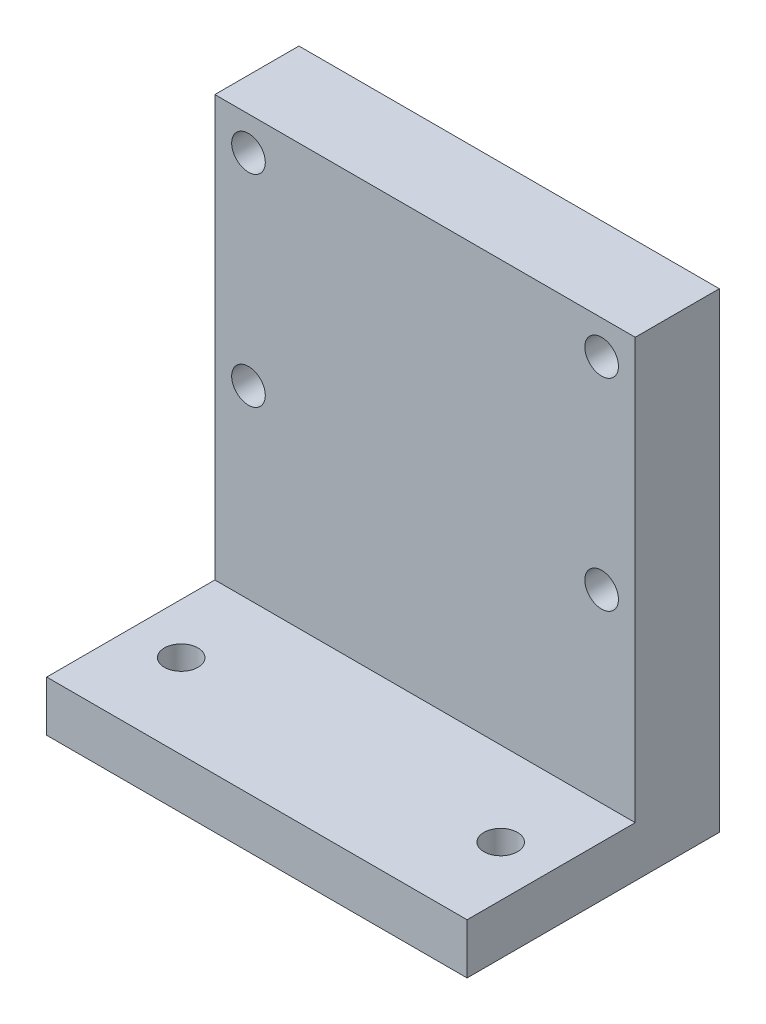
ISO-10303-21;
HEADER;
FILE_DESCRIPTION(('STEP AP214'),'2;1');
FILE_NAME('part.step','',(''),(''),'','','');
FILE_SCHEMA(('AUTOMOTIVE_DESIGN { 1 0 10303 214 1 1 1 1 }'));
ENDSEC;
DATA;
#1=APPLICATION_CONTEXT('core data for automotive mechanical design processes');
#2=APPLICATION_PROTOCOL_DEFINITION('international standard','automotive_design',2000,#1);
#3=PRODUCT_CONTEXT('',#1,'mechanical');
#4=PRODUCT('Part','Part','',(#3));
#5=PRODUCT_RELATED_PRODUCT_CATEGORY('part','',(#4));
#6=PRODUCT_DEFINITION_FORMATION('','',#4);
#7=PRODUCT_DEFINITION_CONTEXT('part definition',#1,'design');
#8=PRODUCT_DEFINITION('design','',#6,#7);
#9=PRODUCT_DEFINITION_SHAPE('','',#8);
#10=(LENGTH_UNIT() NAMED_UNIT(*) SI_UNIT(.MILLI.,.METRE.));
#11=(NAMED_UNIT(*) PLANE_ANGLE_UNIT() SI_UNIT($,.RADIAN.));
#12=(NAMED_UNIT(*) SI_UNIT($,.STERADIAN.) SOLID_ANGLE_UNIT());
#13=UNCERTAINTY_MEASURE_WITH_UNIT(LENGTH_MEASURE(1.E-05),#10,'distance_accuracy_value','');
#14=(GEOMETRIC_REPRESENTATION_CONTEXT(3) GLOBAL_UNCERTAINTY_ASSIGNED_CONTEXT((#13)) GLOBAL_UNIT_ASSIGNED_CONTEXT((#10,
#11,#12)) REPRESENTATION_CONTEXT('',''));
#15=CARTESIAN_POINT('',(0.,0.,0.));
#16=DIRECTION('',(0.,0.,1.));
#17=DIRECTION('',(1.,0.,0.));
#18=AXIS2_PLACEMENT_3D('',#15,#16,#17);
#19=CARTESIAN_POINT('',(7.12290502793296,17.5977653631285,35.));
#20=DIRECTION('',(-1.,0.,0.));
#21=DIRECTION('',(0.,-1.,0.));
#22=AXIS2_PLACEMENT_3D('',#19,#20,#21);
#23=PLANE('',#22);
#24=DIRECTION('',(0.,0.,1.));
#25=VECTOR('',#24,1.);
#26=CARTESIAN_POINT('',(7.12290502793297,-10.4022346368715,20.));
#27=LINE('',#26,#25);
#28=CARTESIAN_POINT('',(7.12290502793297,-10.4022346368715,5.));
#29=VERTEX_POINT('',#28);
#30=CARTESIAN_POINT('',(7.12290502793297,-10.4022346368715,20.));
#31=VERTEX_POINT('',#30);
#32=EDGE_CURVE('E63',#29,#31,#27,.T.);
#33=ORIENTED_EDGE('',*,*,#32,.F.);
#34=DIRECTION('',(0.,-1.,0.));
#35=VECTOR('',#34,1.);
#36=CARTESIAN_POINT('',(7.12290502793297,-10.4022346368715,5.));
#37=LINE('',#36,#35);
#38=CARTESIAN_POINT('',(7.12290502793297,17.5977653631285,5.));
#39=VERTEX_POINT('',#38);
#40=EDGE_CURVE('E56',#39,#29,#37,.T.);
#41=ORIENTED_EDGE('',*,*,#40,.F.);
#42=DIRECTION('',(0.,0.,-1.));
#43=VECTOR('',#42,1.);
#44=CARTESIAN_POINT('',(7.12290502793296,17.5977653631285,35.));
#45=LINE('',#44,#43);
#46=CARTESIAN_POINT('',(7.12290502793297,17.5977653631285,10.));
#47=VERTEX_POINT('',#46);
#48=EDGE_CURVE('E11',#47,#39,#45,.T.);
#49=ORIENTED_EDGE('',*,*,#48,.F.);
#50=DIRECTION('',(0.,1.,0.));
#51=VECTOR('',#50,1.);
#52=CARTESIAN_POINT('',(7.12290502793297,17.5977653631285,10.));
#53=LINE('',#52,#51);
#54=CARTESIAN_POINT('',(7.12290502793297,-7.40223463687151,10.));
#55=VERTEX_POINT('',#54);
#56=EDGE_CURVE('E158',#55,#47,#53,.T.);
#57=ORIENTED_EDGE('',*,*,#56,.F.);
#58=DIRECTION('',(0.,0.,1.));
#59=VECTOR('',#58,1.);
#60=CARTESIAN_POINT('',(7.12290502793297,-7.40223463687151,10.));
#61=LINE('',#60,#59);
#62=CARTESIAN_POINT('',(7.12290502793297,-7.40223463687151,20.));
#63=VERTEX_POINT('',#62);
#64=EDGE_CURVE('E165',#55,#63,#61,.T.);
#65=ORIENTED_EDGE('',*,*,#64,.T.);
#66=DIRECTION('',(0.,1.,0.));
#67=VECTOR('',#66,1.);
#68=CARTESIAN_POINT('',(7.12290502793297,-7.40223463687151,20.));
#69=LINE('',#68,#67);
#70=EDGE_CURVE('E144',#31,#63,#69,.T.);
#71=ORIENTED_EDGE('',*,*,#70,.F.);
#72=EDGE_LOOP('',(#33,#41,#49,#57,#65,#71));
#73=FACE_BOUND('',#72,.T.);
#74=ADVANCED_FACE('F39',(#73),#23,.F.);
#75=CARTESIAN_POINT('',(-17.877094972067,17.5977653631285,35.));
#76=DIRECTION('',(1.,0.,0.));
#77=DIRECTION('',(0.,1.,0.));
#78=AXIS2_PLACEMENT_3D('',#75,#76,#77);
#79=PLANE('',#78);
#80=DIRECTION('',(0.,0.,-1.));
#81=VECTOR('',#80,1.);
#82=CARTESIAN_POINT('',(-17.877094972067,17.5977653631285,35.));
#83=LINE('',#82,#81);
#84=CARTESIAN_POINT('',(-17.877094972067,17.5977653631285,10.));
#85=VERTEX_POINT('',#84);
#86=CARTESIAN_POINT('',(-17.877094972067,17.5977653631285,5.));
#87=VERTEX_POINT('',#86);
#88=EDGE_CURVE('E48',#85,#87,#83,.T.);
#89=ORIENTED_EDGE('',*,*,#88,.T.);
#90=DIRECTION('',(0.,1.,0.));
#91=VECTOR('',#90,1.);
#92=CARTESIAN_POINT('',(-17.877094972067,-10.4022346368715,5.));
#93=LINE('',#92,#91);
#94=CARTESIAN_POINT('',(-17.877094972067,-10.4022346368715,5.));
#95=VERTEX_POINT('',#94);
#96=EDGE_CURVE('E95',#95,#87,#93,.T.);
#97=ORIENTED_EDGE('',*,*,#96,.F.);
#98=DIRECTION('',(0.,0.,-1.));
#99=VECTOR('',#98,1.);
#100=CARTESIAN_POINT('',(-17.877094972067,-10.4022346368715,20.));
#101=LINE('',#100,#99);
#102=CARTESIAN_POINT('',(-17.877094972067,-10.4022346368715,20.));
#103=VERTEX_POINT('',#102);
#104=EDGE_CURVE('E105',#103,#95,#101,.T.);
#105=ORIENTED_EDGE('',*,*,#104,.F.);
#106=DIRECTION('',(0.,-1.,0.));
#107=VECTOR('',#106,1.);
#108=CARTESIAN_POINT('',(-17.877094972067,-7.40223463687151,20.));
#109=LINE('',#108,#107);
#110=CARTESIAN_POINT('',(-17.877094972067,-7.40223463687151,20.));
#111=VERTEX_POINT('',#110);
#112=EDGE_CURVE('E138',#111,#103,#109,.T.);
#113=ORIENTED_EDGE('',*,*,#112,.F.);
#114=DIRECTION('',(0.,0.,1.));
#115=VECTOR('',#114,1.);
#116=CARTESIAN_POINT('',(-17.877094972067,-7.40223463687151,10.));
#117=LINE('',#116,#115);
#118=CARTESIAN_POINT('',(-17.877094972067,-7.40223463687151,10.));
#119=VERTEX_POINT('',#118);
#120=EDGE_CURVE('E164',#119,#111,#117,.T.);
#121=ORIENTED_EDGE('',*,*,#120,.F.);
#122=DIRECTION('',(0.,-1.,0.));
#123=VECTOR('',#122,1.);
#124=CARTESIAN_POINT('',(-17.877094972067,17.5977653631285,10.));
#125=LINE('',#124,#123);
#126=EDGE_CURVE('E150',#85,#119,#125,.T.);
#127=ORIENTED_EDGE('',*,*,#126,.F.);
#128=EDGE_LOOP('',(#89,#97,#105,#113,#121,#127));
#129=FACE_BOUND('',#128,.T.);
#130=ADVANCED_FACE('F103',(#129),#79,.F.);
#131=CARTESIAN_POINT('',(0.,0.,20.));
#132=DIRECTION('',(0.,0.,1.));
#133=DIRECTION('',(1.,0.,0.));
#134=AXIS2_PLACEMENT_3D('',#131,#132,#133);
#135=PLANE('',#134);
#136=ORIENTED_EDGE('',*,*,#112,.T.);
#137=DIRECTION('',(-1.,0.,0.));
#138=VECTOR('',#137,1.);
#139=CARTESIAN_POINT('',(-17.877094972067,-10.4022346368715,20.));
#140=LINE('',#139,#138);
#141=EDGE_CURVE('E114',#31,#103,#140,.T.);
#142=ORIENTED_EDGE('',*,*,#141,.F.);
#143=ORIENTED_EDGE('',*,*,#70,.T.);
#144=DIRECTION('',(-1.,0.,0.));
#145=VECTOR('',#144,1.);
#146=CARTESIAN_POINT('',(-17.877094972067,-7.40223463687151,20.));
#147=LINE('',#146,#145);
#148=EDGE_CURVE('E147',#63,#111,#147,.T.);
#149=ORIENTED_EDGE('',*,*,#148,.T.);
#150=EDGE_LOOP('',(#136,#142,#143,#149));
#151=FACE_BOUND('',#150,.T.);
#152=ADVANCED_FACE('F191',(#151),#135,.T.);
#153=CARTESIAN_POINT('',(4.12290502793297,-22.4022346368715,15.));
#154=DIRECTION('',(0.,1.,0.));
#155=DIRECTION('',(0.,0.,1.));
#156=AXIS2_PLACEMENT_3D('',#153,#154,#155);
#157=CYLINDRICAL_SURFACE('',#156,1.);
#158=CARTESIAN_POINT('',(4.12290502793297,-7.40223463687151,15.));
#159=DIRECTION('',(0.,1.,0.));
#160=DIRECTION('',(0.,0.,1.));
#161=AXIS2_PLACEMENT_3D('',#158,#159,#160);
#162=CIRCLE('',#161,1.);
#163=CARTESIAN_POINT('',(4.12290502793297,-7.40223463687151,16.));
#164=VERTEX_POINT('',#163);
#165=EDGE_CURVE('E133',#164,#164,#162,.T.);
#166=ORIENTED_EDGE('',*,*,#165,.T.);
#167=EDGE_LOOP('',(#166));
#168=FACE_BOUND('',#167,.T.);
#169=CARTESIAN_POINT('',(4.12290502793297,-10.4022346368715,15.));
#170=DIRECTION('',(0.,-1.,0.));
#171=DIRECTION('',(1.,0.,0.));
#172=AXIS2_PLACEMENT_3D('',#169,#170,#171);
#173=CIRCLE('',#172,1.);
#174=CARTESIAN_POINT('',(5.12290502793297,-10.4022346368715,15.));
#175=VERTEX_POINT('',#174);
#176=EDGE_CURVE('E129',#175,#175,#173,.F.);
#177=ORIENTED_EDGE('',*,*,#176,.F.);
#178=EDGE_LOOP('',(#177));
#179=FACE_BOUND('',#178,.T.);
#180=ADVANCED_FACE('F181',(#168,#179),#157,.F.);
#181=CARTESIAN_POINT('',(-14.8779246782045,-22.4022346368715,15.));
#182=DIRECTION('',(0.,1.,0.));
#183=DIRECTION('',(0.,0.,1.));
#184=AXIS2_PLACEMENT_3D('',#181,#182,#183);
#185=CYLINDRICAL_SURFACE('',#184,1.);
#186=CARTESIAN_POINT('',(-14.8779246782045,-7.40223463687151,15.));
#187=DIRECTION('',(0.,1.,0.));
#188=DIRECTION('',(0.,0.,1.));
#189=AXIS2_PLACEMENT_3D('',#186,#187,#188);
#190=CIRCLE('',#189,1.);
#191=CARTESIAN_POINT('',(-14.8779246782045,-7.40223463687151,16.));
#192=VERTEX_POINT('',#191);
#193=EDGE_CURVE('E134',#192,#192,#190,.T.);
#194=ORIENTED_EDGE('',*,*,#193,.T.);
#195=EDGE_LOOP('',(#194));
#196=FACE_BOUND('',#195,.T.);
#197=CARTESIAN_POINT('',(-14.8779246782045,-10.4022346368715,15.));
#198=DIRECTION('',(0.,-1.,0.));
#199=DIRECTION('',(1.,0.,0.));
#200=AXIS2_PLACEMENT_3D('',#197,#198,#199);
#201=CIRCLE('',#200,1.);
#202=CARTESIAN_POINT('',(-13.8779246782045,-10.4022346368715,15.));
#203=VERTEX_POINT('',#202);
#204=EDGE_CURVE('E128',#203,#203,#201,.F.);
#205=ORIENTED_EDGE('',*,*,#204,.F.);
#206=EDGE_LOOP('',(#205));
#207=FACE_BOUND('',#206,.T.);
#208=ADVANCED_FACE('F178',(#196,#207),#185,.F.);
#209=CARTESIAN_POINT('',(-17.877094972067,-7.40223463687151,10.));
#210=DIRECTION('',(0.,-1.,0.));
#211=DIRECTION('',(0.,0.,-1.));
#212=AXIS2_PLACEMENT_3D('',#209,#210,#211);
#213=PLANE('',#212);
#214=ORIENTED_EDGE('',*,*,#193,.F.);
#215=EDGE_LOOP('',(#214));
#216=FACE_BOUND('',#215,.T.);
#217=ORIENTED_EDGE('',*,*,#165,.F.);
#218=EDGE_LOOP('',(#217));
#219=FACE_BOUND('',#218,.T.);
#220=ORIENTED_EDGE('',*,*,#148,.F.);
#221=ORIENTED_EDGE('',*,*,#64,.F.);
#222=DIRECTION('',(1.,0.,0.));
#223=VECTOR('',#222,1.);
#224=CARTESIAN_POINT('',(-17.877094972067,-7.40223463687151,10.));
#225=LINE('',#224,#223);
#226=EDGE_CURVE('E154',#119,#55,#225,.T.);
#227=ORIENTED_EDGE('',*,*,#226,.F.);
#228=ORIENTED_EDGE('',*,*,#120,.T.);
#229=EDGE_LOOP('',(#220,#221,#227,#228));
#230=FACE_BOUND('',#229,.T.);
#231=ADVANCED_FACE('F180',(#216,#219,#230),#213,.F.);
#232=CARTESIAN_POINT('',(7.12290502793296,17.5977653631285,35.));
#233=DIRECTION('',(0.,-1.,0.));
#234=DIRECTION('',(0.,0.,-1.));
#235=AXIS2_PLACEMENT_3D('',#232,#233,#234);
#236=PLANE('',#235);
#237=ORIENTED_EDGE('',*,*,#48,.T.);
#238=DIRECTION('',(1.,0.,0.));
#239=VECTOR('',#238,1.);
#240=CARTESIAN_POINT('',(7.12290502793297,17.5977653631285,5.));
#241=LINE('',#240,#239);
#242=EDGE_CURVE('E110',#87,#39,#241,.T.);
#243=ORIENTED_EDGE('',*,*,#242,.F.);
#244=ORIENTED_EDGE('',*,*,#88,.F.);
#245=DIRECTION('',(-1.,0.,0.));
#246=VECTOR('',#245,1.);
#247=CARTESIAN_POINT('',(-17.877094972067,17.5977653631285,10.));
#248=LINE('',#247,#246);
#249=EDGE_CURVE('E161',#47,#85,#248,.T.);
#250=ORIENTED_EDGE('',*,*,#249,.F.);
#251=EDGE_LOOP('',(#237,#243,#244,#250));
#252=FACE_BOUND('',#251,.T.);
#253=ADVANCED_FACE('F188',(#252),#236,.F.);
#254=CARTESIAN_POINT('',(0.,0.,10.));
#255=DIRECTION('',(0.,0.,1.));
#256=DIRECTION('',(1.,0.,0.));
#257=AXIS2_PLACEMENT_3D('',#254,#255,#256);
#258=PLANE('',#257);
#259=CARTESIAN_POINT('',(5.12290502793297,3.59776536312849,10.));
#260=DIRECTION('',(0.,0.,1.));
#261=DIRECTION('',(1.,0.,0.));
#262=AXIS2_PLACEMENT_3D('',#259,#260,#261);
#263=CIRCLE('',#262,1.);
#264=CARTESIAN_POINT('',(6.12290502793297,3.59776536312849,10.));
#265=VERTEX_POINT('',#264);
#266=EDGE_CURVE('E228',#265,#265,#263,.T.);
#267=ORIENTED_EDGE('',*,*,#266,.F.);
#268=EDGE_LOOP('',(#267));
#269=FACE_BOUND('',#268,.T.);
#270=CARTESIAN_POINT('',(5.12290502793297,15.5977653631285,10.));
#271=DIRECTION('',(0.,0.,1.));
#272=DIRECTION('',(1.,0.,0.));
#273=AXIS2_PLACEMENT_3D('',#270,#271,#272);
#274=CIRCLE('',#273,1.);
#275=CARTESIAN_POINT('',(6.12290502793297,15.5977653631285,10.));
#276=VERTEX_POINT('',#275);
#277=EDGE_CURVE('E232',#276,#276,#274,.T.);
#278=ORIENTED_EDGE('',*,*,#277,.F.);
#279=EDGE_LOOP('',(#278));
#280=FACE_BOUND('',#279,.T.);
#281=CARTESIAN_POINT('',(-15.877094972067,15.5977653631285,10.));
#282=DIRECTION('',(0.,0.,1.));
#283=DIRECTION('',(1.,0.,0.));
#284=AXIS2_PLACEMENT_3D('',#281,#282,#283);
#285=CIRCLE('',#284,1.);
#286=CARTESIAN_POINT('',(-14.877094972067,15.5977653631285,10.));
#287=VERTEX_POINT('',#286);
#288=EDGE_CURVE('E122',#287,#287,#285,.T.);
#289=ORIENTED_EDGE('',*,*,#288,.F.);
#290=EDGE_LOOP('',(#289));
#291=FACE_BOUND('',#290,.T.);
#292=CARTESIAN_POINT('',(-15.877094972067,3.59776536312849,10.));
#293=DIRECTION('',(0.,0.,1.));
#294=DIRECTION('',(1.,0.,0.));
#295=AXIS2_PLACEMENT_3D('',#292,#293,#294);
#296=CIRCLE('',#295,1.);
#297=CARTESIAN_POINT('',(-14.877094972067,3.59776536312849,10.));
#298=VERTEX_POINT('',#297);
#299=EDGE_CURVE('E116',#298,#298,#296,.T.);
#300=ORIENTED_EDGE('',*,*,#299,.F.);
#301=EDGE_LOOP('',(#300));
#302=FACE_BOUND('',#301,.T.);
#303=ORIENTED_EDGE('',*,*,#126,.T.);
#304=ORIENTED_EDGE('',*,*,#226,.T.);
#305=ORIENTED_EDGE('',*,*,#56,.T.);
#306=ORIENTED_EDGE('',*,*,#249,.T.);
#307=EDGE_LOOP('',(#303,#304,#305,#306));
#308=FACE_BOUND('',#307,.T.);
#309=ADVANCED_FACE('F241',(#269,#280,#291,#302,#308),#258,.T.);
#310=CARTESIAN_POINT('',(0.,-10.4022346368715,0.));
#311=DIRECTION('',(0.,-1.,0.));
#312=DIRECTION('',(1.,0.,0.));
#313=AXIS2_PLACEMENT_3D('',#310,#311,#312);
#314=PLANE('',#313);
#315=DIRECTION('',(-1.,0.,0.));
#316=VECTOR('',#315,1.);
#317=CARTESIAN_POINT('',(7.12290502793297,-10.4022346368715,5.));
#318=LINE('',#317,#316);
#319=EDGE_CURVE('E91',#29,#95,#318,.T.);
#320=ORIENTED_EDGE('',*,*,#319,.F.);
#321=ORIENTED_EDGE('',*,*,#32,.T.);
#322=ORIENTED_EDGE('',*,*,#141,.T.);
#323=ORIENTED_EDGE('',*,*,#104,.T.);
#324=EDGE_LOOP('',(#320,#321,#322,#323));
#325=FACE_BOUND('',#324,.T.);
#326=ORIENTED_EDGE('',*,*,#204,.T.);
#327=EDGE_LOOP('',(#326));
#328=FACE_BOUND('',#327,.T.);
#329=ORIENTED_EDGE('',*,*,#176,.T.);
#330=EDGE_LOOP('',(#329));
#331=FACE_BOUND('',#330,.T.);
#332=ADVANCED_FACE('F112',(#325,#328,#331),#314,.T.);
#333=CARTESIAN_POINT('',(-15.877094972067,3.59776536312849,-5.));
#334=DIRECTION('',(0.,0.,1.));
#335=DIRECTION('',(1.,0.,0.));
#336=AXIS2_PLACEMENT_3D('',#333,#334,#335);
#337=CYLINDRICAL_SURFACE('',#336,1.);
#338=CARTESIAN_POINT('',(-15.877094972067,3.59776536312849,5.));
#339=DIRECTION('',(0.,0.,1.));
#340=DIRECTION('',(1.,0.,0.));
#341=AXIS2_PLACEMENT_3D('',#338,#339,#340);
#342=CIRCLE('',#341,1.);
#343=CARTESIAN_POINT('',(-14.877094972067,3.59776536312849,5.));
#344=VERTEX_POINT('',#343);
#345=EDGE_CURVE('E224',#344,#344,#342,.F.);
#346=ORIENTED_EDGE('',*,*,#345,.T.);
#347=EDGE_LOOP('',(#346));
#348=FACE_BOUND('',#347,.T.);
#349=ORIENTED_EDGE('',*,*,#299,.T.);
#350=EDGE_LOOP('',(#349));
#351=FACE_BOUND('',#350,.T.);
#352=ADVANCED_FACE('F251',(#348,#351),#337,.F.);
#353=CARTESIAN_POINT('',(-15.877094972067,15.5977653631285,-5.));
#354=DIRECTION('',(0.,0.,1.));
#355=DIRECTION('',(1.,0.,0.));
#356=AXIS2_PLACEMENT_3D('',#353,#354,#355);
#357=CYLINDRICAL_SURFACE('',#356,1.);
#358=CARTESIAN_POINT('',(-15.877094972067,15.5977653631285,5.));
#359=DIRECTION('',(0.,0.,1.));
#360=DIRECTION('',(1.,0.,0.));
#361=AXIS2_PLACEMENT_3D('',#358,#359,#360);
#362=CIRCLE('',#361,1.);
#363=CARTESIAN_POINT('',(-14.877094972067,15.5977653631285,5.));
#364=VERTEX_POINT('',#363);
#365=EDGE_CURVE('E220',#364,#364,#362,.F.);
#366=ORIENTED_EDGE('',*,*,#365,.T.);
#367=EDGE_LOOP('',(#366));
#368=FACE_BOUND('',#367,.T.);
#369=ORIENTED_EDGE('',*,*,#288,.T.);
#370=EDGE_LOOP('',(#369));
#371=FACE_BOUND('',#370,.T.);
#372=ADVANCED_FACE('F253',(#368,#371),#357,.F.);
#373=CARTESIAN_POINT('',(5.12290502793297,15.5977653631285,-5.));
#374=DIRECTION('',(0.,0.,1.));
#375=DIRECTION('',(1.,0.,0.));
#376=AXIS2_PLACEMENT_3D('',#373,#374,#375);
#377=CYLINDRICAL_SURFACE('',#376,1.);
#378=CARTESIAN_POINT('',(5.12290502793297,15.5977653631285,5.));
#379=DIRECTION('',(0.,0.,1.));
#380=DIRECTION('',(1.,0.,0.));
#381=AXIS2_PLACEMENT_3D('',#378,#379,#380);
#382=CIRCLE('',#381,1.);
#383=CARTESIAN_POINT('',(6.12290502793297,15.5977653631285,5.));
#384=VERTEX_POINT('',#383);
#385=EDGE_CURVE('E215',#384,#384,#382,.F.);
#386=ORIENTED_EDGE('',*,*,#385,.T.);
#387=EDGE_LOOP('',(#386));
#388=FACE_BOUND('',#387,.T.);
#389=ORIENTED_EDGE('',*,*,#277,.T.);
#390=EDGE_LOOP('',(#389));
#391=FACE_BOUND('',#390,.T.);
#392=ADVANCED_FACE('F260',(#388,#391),#377,.F.);
#393=CARTESIAN_POINT('',(5.12290502793297,3.59776536312849,-5.));
#394=DIRECTION('',(0.,0.,1.));
#395=DIRECTION('',(1.,0.,0.));
#396=AXIS2_PLACEMENT_3D('',#393,#394,#395);
#397=CYLINDRICAL_SURFACE('',#396,1.);
#398=CARTESIAN_POINT('',(5.12290502793297,3.59776536312849,5.));
#399=DIRECTION('',(0.,0.,1.));
#400=DIRECTION('',(1.,0.,0.));
#401=AXIS2_PLACEMENT_3D('',#398,#399,#400);
#402=CIRCLE('',#401,1.);
#403=CARTESIAN_POINT('',(6.12290502793297,3.59776536312849,5.));
#404=VERTEX_POINT('',#403);
#405=EDGE_CURVE('E42',#404,#404,#402,.F.);
#406=ORIENTED_EDGE('',*,*,#405,.T.);
#407=EDGE_LOOP('',(#406));
#408=FACE_BOUND('',#407,.T.);
#409=ORIENTED_EDGE('',*,*,#266,.T.);
#410=EDGE_LOOP('',(#409));
#411=FACE_BOUND('',#410,.T.);
#412=ADVANCED_FACE('F239',(#408,#411),#397,.F.);
#413=CARTESIAN_POINT('',(0.,0.,5.));
#414=DIRECTION('',(0.,0.,1.));
#415=DIRECTION('',(1.,0.,0.));
#416=AXIS2_PLACEMENT_3D('',#413,#414,#415);
#417=PLANE('',#416);
#418=ORIENTED_EDGE('',*,*,#365,.F.);
#419=EDGE_LOOP('',(#418));
#420=FACE_BOUND('',#419,.T.);
#421=ORIENTED_EDGE('',*,*,#405,.F.);
#422=EDGE_LOOP('',(#421));
#423=FACE_BOUND('',#422,.T.);
#424=ORIENTED_EDGE('',*,*,#40,.T.);
#425=ORIENTED_EDGE('',*,*,#319,.T.);
#426=ORIENTED_EDGE('',*,*,#96,.T.);
#427=ORIENTED_EDGE('',*,*,#242,.T.);
#428=EDGE_LOOP('',(#424,#425,#426,#427));
#429=FACE_BOUND('',#428,.T.);
#430=ORIENTED_EDGE('',*,*,#385,.F.);
#431=EDGE_LOOP('',(#430));
#432=FACE_BOUND('',#431,.T.);
#433=ORIENTED_EDGE('',*,*,#345,.F.);
#434=EDGE_LOOP('',(#433));
#435=FACE_BOUND('',#434,.T.);
#436=ADVANCED_FACE('F93',(#420,#423,#429,#432,#435),#417,.F.);
#437=CLOSED_SHELL('',(#74,#130,#152,#180,#208,#231,#253,#309,#332,#352,#372,#392,#412,#436));
#438=MANIFOLD_SOLID_BREP('B2',#437);
#439=ADVANCED_BREP_SHAPE_REPRESENTATION('',(#18,#438),#14);
#440=SHAPE_DEFINITION_REPRESENTATION(#9,#439);
ENDSEC;
END-ISO-10303-21;
